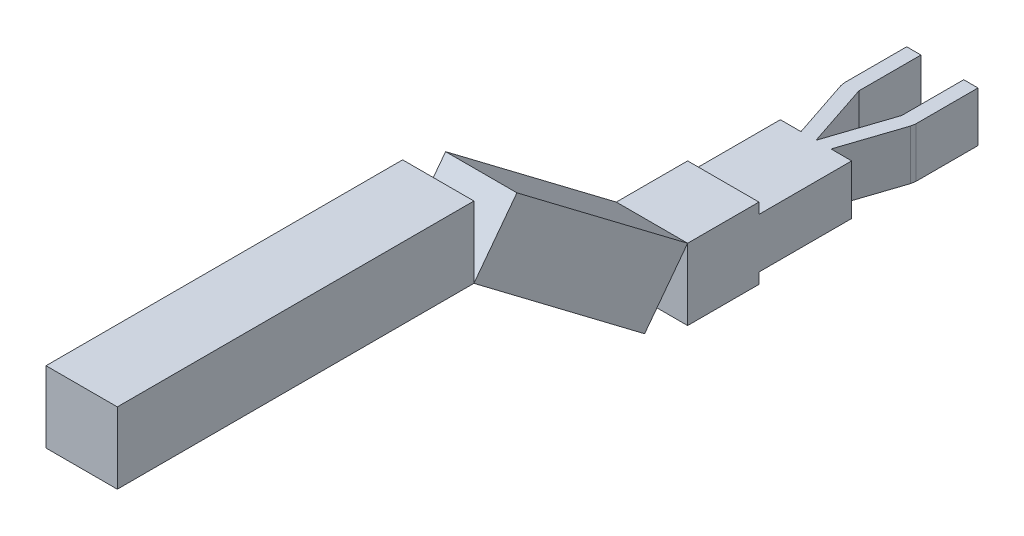
ISO-10303-21;
HEADER;
FILE_DESCRIPTION(('STEP AP214'),'2;1');
FILE_NAME('part.step','',(''),(''),'','','');
FILE_SCHEMA(('AUTOMOTIVE_DESIGN { 1 0 10303 214 1 1 1 1 }'));
ENDSEC;
DATA;
#1=APPLICATION_CONTEXT('core data for automotive mechanical design processes');
#2=APPLICATION_PROTOCOL_DEFINITION('international standard','automotive_design',2000,#1);
#3=PRODUCT_CONTEXT('',#1,'mechanical');
#4=PRODUCT('Part','Part','',(#3));
#5=PRODUCT_RELATED_PRODUCT_CATEGORY('part','',(#4));
#6=PRODUCT_DEFINITION_FORMATION('','',#4);
#7=PRODUCT_DEFINITION_CONTEXT('part definition',#1,'design');
#8=PRODUCT_DEFINITION('design','',#6,#7);
#9=PRODUCT_DEFINITION_SHAPE('','',#8);
#10=(LENGTH_UNIT() NAMED_UNIT(*) SI_UNIT(.MILLI.,.METRE.));
#11=(NAMED_UNIT(*) PLANE_ANGLE_UNIT() SI_UNIT($,.RADIAN.));
#12=(NAMED_UNIT(*) SI_UNIT($,.STERADIAN.) SOLID_ANGLE_UNIT());
#13=UNCERTAINTY_MEASURE_WITH_UNIT(LENGTH_MEASURE(1.E-05),#10,'distance_accuracy_value','');
#14=(GEOMETRIC_REPRESENTATION_CONTEXT(3) GLOBAL_UNCERTAINTY_ASSIGNED_CONTEXT((#13)) GLOBAL_UNIT_ASSIGNED_CONTEXT((#10,
#11,#12)) REPRESENTATION_CONTEXT('',''));
#15=CARTESIAN_POINT('',(0.,0.,0.));
#16=DIRECTION('',(0.,0.,1.));
#17=DIRECTION('',(1.,0.,0.));
#18=AXIS2_PLACEMENT_3D('',#15,#16,#17);
#19=CARTESIAN_POINT('',(50.0000000000001,186.100667301287,635.399647205051));
#20=DIRECTION('',(0.,0.,-1.));
#21=DIRECTION('',(-1.,0.,0.));
#22=AXIS2_PLACEMENT_3D('',#19,#20,#21);
#23=PLANE('',#22);
#24=DIRECTION('',(0.,-1.,0.));
#25=VECTOR('',#24,1.);
#26=CARTESIAN_POINT('',(-50.,186.100667301287,635.399647205051));
#27=LINE('',#26,#25);
#28=CARTESIAN_POINT('',(-50.,286.100667301287,635.399647205051));
#29=VERTEX_POINT('',#28);
#30=CARTESIAN_POINT('',(-50.,186.100667301287,635.399647205051));
#31=VERTEX_POINT('',#30);
#32=EDGE_CURVE('E108',#29,#31,#27,.T.);
#33=ORIENTED_EDGE('',*,*,#32,.F.);
#34=DIRECTION('',(-1.,0.,0.));
#35=VECTOR('',#34,1.);
#36=CARTESIAN_POINT('',(50.0000000000001,286.100667301287,635.399647205051));
#37=LINE('',#36,#35);
#38=CARTESIAN_POINT('',(50.0000000000001,286.100667301287,635.399647205051));
#39=VERTEX_POINT('',#38);
#40=EDGE_CURVE('E12',#39,#29,#37,.T.);
#41=ORIENTED_EDGE('',*,*,#40,.F.);
#42=DIRECTION('',(0.,-1.,0.));
#43=VECTOR('',#42,1.);
#44=CARTESIAN_POINT('',(50.0000000000001,186.100667301287,635.399647205051));
#45=LINE('',#44,#43);
#46=CARTESIAN_POINT('',(50.0000000000001,186.100667301287,635.399647205051));
#47=VERTEX_POINT('',#46);
#48=EDGE_CURVE('E102',#39,#47,#45,.T.);
#49=ORIENTED_EDGE('',*,*,#48,.T.);
#50=DIRECTION('',(-1.,0.,0.));
#51=VECTOR('',#50,1.);
#52=CARTESIAN_POINT('',(50.0000000000001,186.100667301287,635.399647205051));
#53=LINE('',#52,#51);
#54=EDGE_CURVE('E47',#47,#31,#53,.T.);
#55=ORIENTED_EDGE('',*,*,#54,.T.);
#56=EDGE_LOOP('',(#33,#41,#49,#55));
#57=FACE_BOUND('',#56,.T.);
#58=ADVANCED_FACE('F44',(#57),#23,.T.);
#59=CARTESIAN_POINT('',(50.0000000000001,286.100667301287,635.399647205051));
#60=DIRECTION('',(0.,1.,0.));
#61=DIRECTION('',(-1.,0.,0.));
#62=AXIS2_PLACEMENT_3D('',#59,#60,#61);
#63=PLANE('',#62);
#64=DIRECTION('',(0.,0.,-1.));
#65=VECTOR('',#64,1.);
#66=CARTESIAN_POINT('',(-50.,286.100667301287,635.399647205051));
#67=LINE('',#66,#65);
#68=CARTESIAN_POINT('',(-49.9999999999999,286.100667301287,1135.39964720505));
#69=VERTEX_POINT('',#68);
#70=EDGE_CURVE('E104',#69,#29,#67,.T.);
#71=ORIENTED_EDGE('',*,*,#70,.F.);
#72=DIRECTION('',(-1.,0.,0.));
#73=VECTOR('',#72,1.);
#74=CARTESIAN_POINT('',(50.0000000000001,286.100667301287,1135.39964720505));
#75=LINE('',#74,#73);
#76=CARTESIAN_POINT('',(50.0000000000001,286.100667301287,1135.39964720505));
#77=VERTEX_POINT('',#76);
#78=EDGE_CURVE('E53',#77,#69,#75,.T.);
#79=ORIENTED_EDGE('',*,*,#78,.F.);
#80=DIRECTION('',(0.,0.,-1.));
#81=VECTOR('',#80,1.);
#82=CARTESIAN_POINT('',(50.0000000000001,286.100667301287,635.399647205051));
#83=LINE('',#82,#81);
#84=EDGE_CURVE('E99',#77,#39,#83,.T.);
#85=ORIENTED_EDGE('',*,*,#84,.T.);
#86=ORIENTED_EDGE('',*,*,#40,.T.);
#87=EDGE_LOOP('',(#71,#79,#85,#86));
#88=FACE_BOUND('',#87,.T.);
#89=ADVANCED_FACE('F118',(#88),#63,.T.);
#90=CARTESIAN_POINT('',(50.0000000000001,186.100667301287,1135.39964720505));
#91=DIRECTION('',(0.,0.,1.));
#92=DIRECTION('',(1.,0.,0.));
#93=AXIS2_PLACEMENT_3D('',#90,#91,#92);
#94=PLANE('',#93);
#95=DIRECTION('',(0.,1.,0.));
#96=VECTOR('',#95,1.);
#97=CARTESIAN_POINT('',(-49.9999999999999,186.100667301287,1135.39964720505));
#98=LINE('',#97,#96);
#99=CARTESIAN_POINT('',(-49.9999999999999,186.100667301287,1135.39964720505));
#100=VERTEX_POINT('',#99);
#101=EDGE_CURVE('E94',#100,#69,#98,.T.);
#102=ORIENTED_EDGE('',*,*,#101,.F.);
#103=DIRECTION('',(-1.,0.,0.));
#104=VECTOR('',#103,1.);
#105=CARTESIAN_POINT('',(50.0000000000001,186.100667301287,1135.39964720505));
#106=LINE('',#105,#104);
#107=CARTESIAN_POINT('',(50.0000000000001,186.100667301287,1135.39964720505));
#108=VERTEX_POINT('',#107);
#109=EDGE_CURVE('E89',#108,#100,#106,.T.);
#110=ORIENTED_EDGE('',*,*,#109,.F.);
#111=DIRECTION('',(0.,1.,0.));
#112=VECTOR('',#111,1.);
#113=CARTESIAN_POINT('',(50.0000000000001,186.100667301287,1135.39964720505));
#114=LINE('',#113,#112);
#115=EDGE_CURVE('E92',#108,#77,#114,.T.);
#116=ORIENTED_EDGE('',*,*,#115,.T.);
#117=ORIENTED_EDGE('',*,*,#78,.T.);
#118=EDGE_LOOP('',(#102,#110,#116,#117));
#119=FACE_BOUND('',#118,.T.);
#120=ADVANCED_FACE('F91',(#119),#94,.T.);
#121=CARTESIAN_POINT('',(50.0000000000001,186.100667301287,635.399647205051));
#122=DIRECTION('',(0.,-1.,0.));
#123=DIRECTION('',(1.,0.,0.));
#124=AXIS2_PLACEMENT_3D('',#121,#122,#123);
#125=PLANE('',#124);
#126=DIRECTION('',(0.,0.,1.));
#127=VECTOR('',#126,1.);
#128=CARTESIAN_POINT('',(-50.,186.100667301287,635.399647205051));
#129=LINE('',#128,#127);
#130=EDGE_CURVE('E111',#31,#100,#129,.T.);
#131=ORIENTED_EDGE('',*,*,#130,.F.);
#132=ORIENTED_EDGE('',*,*,#54,.F.);
#133=DIRECTION('',(0.,0.,1.));
#134=VECTOR('',#133,1.);
#135=CARTESIAN_POINT('',(50.0000000000001,186.100667301287,635.399647205051));
#136=LINE('',#135,#134);
#137=EDGE_CURVE('E98',#47,#108,#136,.T.);
#138=ORIENTED_EDGE('',*,*,#137,.T.);
#139=ORIENTED_EDGE('',*,*,#109,.T.);
#140=EDGE_LOOP('',(#131,#132,#138,#139));
#141=FACE_BOUND('',#140,.T.);
#142=ADVANCED_FACE('F101',(#141),#125,.T.);
#143=CARTESIAN_POINT('',(50.,0.,0.));
#144=DIRECTION('',(1.,0.,0.));
#145=DIRECTION('',(0.,0.,-1.));
#146=AXIS2_PLACEMENT_3D('',#143,#144,#145);
#147=PLANE('',#146);
#148=ORIENTED_EDGE('',*,*,#48,.F.);
#149=ORIENTED_EDGE('',*,*,#84,.F.);
#150=ORIENTED_EDGE('',*,*,#115,.F.);
#151=ORIENTED_EDGE('',*,*,#137,.F.);
#152=EDGE_LOOP('',(#148,#149,#150,#151));
#153=FACE_BOUND('',#152,.T.);
#154=ADVANCED_FACE('F97',(#153),#147,.T.);
#155=CARTESIAN_POINT('',(-50.,0.,0.));
#156=DIRECTION('',(1.,0.,0.));
#157=DIRECTION('',(0.,0.,-1.));
#158=AXIS2_PLACEMENT_3D('',#155,#156,#157);
#159=PLANE('',#158);
#160=ORIENTED_EDGE('',*,*,#32,.T.);
#161=ORIENTED_EDGE('',*,*,#130,.T.);
#162=ORIENTED_EDGE('',*,*,#101,.T.);
#163=ORIENTED_EDGE('',*,*,#70,.T.);
#164=EDGE_LOOP('',(#160,#161,#162,#163));
#165=FACE_BOUND('',#164,.T.);
#166=ADVANCED_FACE('F117',(#165),#159,.F.);
#167=CLOSED_SHELL('',(#58,#89,#120,#142,#154,#166));
#168=MANIFOLD_SOLID_BREP('B2',#167);
#169=CARTESIAN_POINT('',(50.,85.,335.768782521129));
#170=DIRECTION('',(0.,0.797791926750478,-0.602932866587782));
#171=DIRECTION('',(0.,0.602932866587782,0.797791926750478));
#172=AXIS2_PLACEMENT_3D('',#169,#170,#171);
#173=PLANE('',#172);
#174=DIRECTION('',(0.,-0.602932866587782,-0.797791926750478));
#175=VECTOR('',#174,1.);
#176=CARTESIAN_POINT('',(-50.,85.,335.768782521129));
#177=LINE('',#176,#175);
#178=CARTESIAN_POINT('',(-50.,265.879859976335,575.106360546273));
#179=VERTEX_POINT('',#178);
#180=CARTESIAN_POINT('',(-50.,85.,335.768782521129));
#181=VERTEX_POINT('',#180);
#182=EDGE_CURVE('E241',#179,#181,#177,.T.);
#183=ORIENTED_EDGE('',*,*,#182,.F.);
#184=DIRECTION('',(-1.,0.,0.));
#185=VECTOR('',#184,1.);
#186=CARTESIAN_POINT('',(50.,265.879859976335,575.106360546273));
#187=LINE('',#186,#185);
#188=CARTESIAN_POINT('',(50.,265.879859976335,575.106360546273));
#189=VERTEX_POINT('',#188);
#190=EDGE_CURVE('E42',#189,#179,#187,.T.);
#191=ORIENTED_EDGE('',*,*,#190,.F.);
#192=DIRECTION('',(0.,-0.602932866587782,-0.797791926750478));
#193=VECTOR('',#192,1.);
#194=CARTESIAN_POINT('',(50.,85.,335.768782521129));
#195=LINE('',#194,#193);
#196=CARTESIAN_POINT('',(50.,85.,335.768782521129));
#197=VERTEX_POINT('',#196);
#198=EDGE_CURVE('E235',#189,#197,#195,.T.);
#199=ORIENTED_EDGE('',*,*,#198,.T.);
#200=DIRECTION('',(-1.,0.,0.));
#201=VECTOR('',#200,1.);
#202=CARTESIAN_POINT('',(50.,85.,335.768782521129));
#203=LINE('',#202,#201);
#204=EDGE_CURVE('E180',#197,#181,#203,.T.);
#205=ORIENTED_EDGE('',*,*,#204,.T.);
#206=EDGE_LOOP('',(#183,#191,#199,#205));
#207=FACE_BOUND('',#206,.T.);
#208=ADVANCED_FACE('F177',(#207),#173,.T.);
#209=CARTESIAN_POINT('',(50.,265.879859976335,575.106360546273));
#210=DIRECTION('',(0.,0.602932866587782,0.797791926750478));
#211=DIRECTION('',(0.,-0.797791926750478,0.602932866587782));
#212=AXIS2_PLACEMENT_3D('',#209,#210,#211);
#213=PLANE('',#212);
#214=DIRECTION('',(0.,0.797791926750478,-0.602932866587782));
#215=VECTOR('',#214,1.);
#216=CARTESIAN_POINT('',(-50.,265.879859976335,575.106360546273));
#217=LINE('',#216,#215);
#218=CARTESIAN_POINT('',(-50.,186.100667301287,635.399647205051));
#219=VERTEX_POINT('',#218);
#220=EDGE_CURVE('E237',#219,#179,#217,.T.);
#221=ORIENTED_EDGE('',*,*,#220,.F.);
#222=DIRECTION('',(-1.,0.,0.));
#223=VECTOR('',#222,1.);
#224=CARTESIAN_POINT('',(50.0000000000001,186.100667301287,635.399647205051));
#225=LINE('',#224,#223);
#226=CARTESIAN_POINT('',(50.0000000000001,186.100667301287,635.399647205051));
#227=VERTEX_POINT('',#226);
#228=EDGE_CURVE('E186',#227,#219,#225,.T.);
#229=ORIENTED_EDGE('',*,*,#228,.F.);
#230=DIRECTION('',(0.,0.797791926750478,-0.602932866587782));
#231=VECTOR('',#230,1.);
#232=CARTESIAN_POINT('',(50.,265.879859976335,575.106360546273));
#233=LINE('',#232,#231);
#234=EDGE_CURVE('E232',#227,#189,#233,.T.);
#235=ORIENTED_EDGE('',*,*,#234,.T.);
#236=ORIENTED_EDGE('',*,*,#190,.T.);
#237=EDGE_LOOP('',(#221,#229,#235,#236));
#238=FACE_BOUND('',#237,.T.);
#239=ADVANCED_FACE('F251',(#238),#213,.T.);
#240=CARTESIAN_POINT('',(50.,5.22080732495214,396.062069179907));
#241=DIRECTION('',(0.,-0.797791926750478,0.602932866587782));
#242=DIRECTION('',(0.,-0.602932866587782,-0.797791926750478));
#243=AXIS2_PLACEMENT_3D('',#240,#241,#242);
#244=PLANE('',#243);
#245=DIRECTION('',(0.,0.602932866587782,0.797791926750478));
#246=VECTOR('',#245,1.);
#247=CARTESIAN_POINT('',(-50.,5.22080732495214,396.062069179907));
#248=LINE('',#247,#246);
#249=CARTESIAN_POINT('',(-50.,5.22080732495214,396.062069179907));
#250=VERTEX_POINT('',#249);
#251=EDGE_CURVE('E227',#250,#219,#248,.T.);
#252=ORIENTED_EDGE('',*,*,#251,.F.);
#253=DIRECTION('',(-1.,0.,0.));
#254=VECTOR('',#253,1.);
#255=CARTESIAN_POINT('',(50.,5.22080732495214,396.062069179907));
#256=LINE('',#255,#254);
#257=CARTESIAN_POINT('',(50.,5.22080732495214,396.062069179907));
#258=VERTEX_POINT('',#257);
#259=EDGE_CURVE('E222',#258,#250,#256,.T.);
#260=ORIENTED_EDGE('',*,*,#259,.F.);
#261=DIRECTION('',(0.,0.602932866587782,0.797791926750478));
#262=VECTOR('',#261,1.);
#263=CARTESIAN_POINT('',(50.,5.22080732495214,396.062069179907));
#264=LINE('',#263,#262);
#265=EDGE_CURVE('E225',#258,#227,#264,.T.);
#266=ORIENTED_EDGE('',*,*,#265,.T.);
#267=ORIENTED_EDGE('',*,*,#228,.T.);
#268=EDGE_LOOP('',(#252,#260,#266,#267));
#269=FACE_BOUND('',#268,.T.);
#270=ADVANCED_FACE('F224',(#269),#244,.T.);
#271=CARTESIAN_POINT('',(50.,85.,335.768782521129));
#272=DIRECTION('',(0.,-0.602932866587781,-0.797791926750478));
#273=DIRECTION('',(0.,0.797791926750478,-0.602932866587781));
#274=AXIS2_PLACEMENT_3D('',#271,#272,#273);
#275=PLANE('',#274);
#276=DIRECTION('',(0.,-0.797791926750478,0.602932866587781));
#277=VECTOR('',#276,1.);
#278=CARTESIAN_POINT('',(-50.,85.,335.768782521129));
#279=LINE('',#278,#277);
#280=EDGE_CURVE('E244',#181,#250,#279,.T.);
#281=ORIENTED_EDGE('',*,*,#280,.F.);
#282=ORIENTED_EDGE('',*,*,#204,.F.);
#283=DIRECTION('',(0.,-0.797791926750478,0.602932866587781));
#284=VECTOR('',#283,1.);
#285=CARTESIAN_POINT('',(50.,85.,335.768782521129));
#286=LINE('',#285,#284);
#287=EDGE_CURVE('E231',#197,#258,#286,.T.);
#288=ORIENTED_EDGE('',*,*,#287,.T.);
#289=ORIENTED_EDGE('',*,*,#259,.T.);
#290=EDGE_LOOP('',(#281,#282,#288,#289));
#291=FACE_BOUND('',#290,.T.);
#292=ADVANCED_FACE('F234',(#291),#275,.T.);
#293=CARTESIAN_POINT('',(50.,0.,0.));
#294=DIRECTION('',(1.,0.,0.));
#295=DIRECTION('',(0.,0.,-1.));
#296=AXIS2_PLACEMENT_3D('',#293,#294,#295);
#297=PLANE('',#296);
#298=ORIENTED_EDGE('',*,*,#198,.F.);
#299=ORIENTED_EDGE('',*,*,#234,.F.);
#300=ORIENTED_EDGE('',*,*,#265,.F.);
#301=ORIENTED_EDGE('',*,*,#287,.F.);
#302=EDGE_LOOP('',(#298,#299,#300,#301));
#303=FACE_BOUND('',#302,.T.);
#304=ADVANCED_FACE('F230',(#303),#297,.T.);
#305=CARTESIAN_POINT('',(-50.,0.,0.));
#306=DIRECTION('',(1.,0.,0.));
#307=DIRECTION('',(0.,0.,-1.));
#308=AXIS2_PLACEMENT_3D('',#305,#306,#307);
#309=PLANE('',#308);
#310=ORIENTED_EDGE('',*,*,#182,.T.);
#311=ORIENTED_EDGE('',*,*,#280,.T.);
#312=ORIENTED_EDGE('',*,*,#251,.T.);
#313=ORIENTED_EDGE('',*,*,#220,.T.);
#314=EDGE_LOOP('',(#310,#311,#312,#313));
#315=FACE_BOUND('',#314,.T.);
#316=ADVANCED_FACE('F250',(#315),#309,.F.);
#317=CLOSED_SHELL('',(#208,#239,#270,#292,#304,#316));
#318=MANIFOLD_SOLID_BREP('B6',#317);
#319=CARTESIAN_POINT('',(-50.,70.,-71.3699993654707));
#320=DIRECTION('',(1.,0.,0.));
#321=DIRECTION('',(0.,0.,-1.));
#322=AXIS2_PLACEMENT_3D('',#319,#320,#321);
#323=PLANE('',#322);
#324=DIRECTION('',(0.,0.,1.));
#325=VECTOR('',#324,1.);
#326=CARTESIAN_POINT('',(-50.,0.,-71.3699993654707));
#327=LINE('',#326,#325);
#328=CARTESIAN_POINT('',(-50.,0.,-71.3699993654707));
#329=VERTEX_POINT('',#328);
#330=CARTESIAN_POINT('',(-50.,0.,15.6300006345293));
#331=VERTEX_POINT('',#330);
#332=EDGE_CURVE('E447',#329,#331,#327,.T.);
#333=ORIENTED_EDGE('',*,*,#332,.T.);
#334=DIRECTION('',(0.,-1.,0.));
#335=VECTOR('',#334,1.);
#336=CARTESIAN_POINT('',(-50.,70.,15.6300006345293));
#337=LINE('',#336,#335);
#338=CARTESIAN_POINT('',(-50.,70.,15.6300006345293));
#339=VERTEX_POINT('',#338);
#340=EDGE_CURVE('E175',#339,#331,#337,.T.);
#341=ORIENTED_EDGE('',*,*,#340,.F.);
#342=DIRECTION('',(0.,0.,1.));
#343=VECTOR('',#342,1.);
#344=CARTESIAN_POINT('',(-50.,70.,-71.3699993654707));
#345=LINE('',#344,#343);
#346=CARTESIAN_POINT('',(-50.,70.,-71.3699993654707));
#347=VERTEX_POINT('',#346);
#348=EDGE_CURVE('E497',#347,#339,#345,.T.);
#349=ORIENTED_EDGE('',*,*,#348,.F.);
#350=DIRECTION('',(0.,-1.,0.));
#351=VECTOR('',#350,1.);
#352=CARTESIAN_POINT('',(-50.,70.,-71.3699993654707));
#353=LINE('',#352,#351);
#354=EDGE_CURVE('E443',#347,#329,#353,.T.);
#355=ORIENTED_EDGE('',*,*,#354,.T.);
#356=EDGE_LOOP('',(#333,#341,#349,#355));
#357=FACE_BOUND('',#356,.T.);
#358=ADVANCED_FACE('F301',(#357),#323,.F.);
#359=CARTESIAN_POINT('',(-48.9765856603368,70.,21.9457901082135));
#360=DIRECTION('',(0.98712443061066,0.,-0.159954238742149));
#361=DIRECTION('',(-0.159954238742149,0.,-0.98712443061066));
#362=AXIS2_PLACEMENT_3D('',#359,#360,#361);
#363=PLANE('',#362);
#364=DIRECTION('',(0.159954238742149,0.,0.98712443061066));
#365=VECTOR('',#364,1.);
#366=CARTESIAN_POINT('',(-48.9765856603368,0.,21.9457901082135));
#367=LINE('',#366,#365);
#368=CARTESIAN_POINT('',(-48.9765856603368,0.,21.9457901082135));
#369=VERTEX_POINT('',#368);
#370=EDGE_CURVE('E450',#331,#369,#367,.T.);
#371=ORIENTED_EDGE('',*,*,#370,.T.);
#372=DIRECTION('',(0.,-1.,0.));
#373=VECTOR('',#372,1.);
#374=CARTESIAN_POINT('',(-48.9765856603368,70.,21.9457901082135));
#375=LINE('',#374,#373);
#376=CARTESIAN_POINT('',(-48.9765856603368,70.,21.9457901082135));
#377=VERTEX_POINT('',#376);
#378=EDGE_CURVE('E310',#377,#369,#375,.T.);
#379=ORIENTED_EDGE('',*,*,#378,.F.);
#380=DIRECTION('',(0.159954238742149,0.,0.98712443061066));
#381=VECTOR('',#380,1.);
#382=CARTESIAN_POINT('',(-48.9765856603368,70.,21.9457901082135));
#383=LINE('',#382,#381);
#384=EDGE_CURVE('E384',#339,#377,#383,.T.);
#385=ORIENTED_EDGE('',*,*,#384,.F.);
#386=ORIENTED_EDGE('',*,*,#340,.T.);
#387=EDGE_LOOP('',(#371,#379,#385,#386));
#388=FACE_BOUND('',#387,.T.);
#389=ADVANCED_FACE('F578',(#388),#363,.F.);
#390=CARTESIAN_POINT('',(-21.0786074565587,70.,105.768782521129));
#391=DIRECTION('',(0.948829283016839,0.,-0.315789473684211));
#392=DIRECTION('',(-0.315789473684211,0.,-0.948829283016839));
#393=AXIS2_PLACEMENT_3D('',#390,#391,#392);
#394=PLANE('',#393);
#395=DIRECTION('',(0.31578947368421,0.,0.948829283016839));
#396=VECTOR('',#395,1.);
#397=CARTESIAN_POINT('',(-21.0786074565587,0.,105.768782521129));
#398=LINE('',#397,#396);
#399=CARTESIAN_POINT('',(-21.0786074565587,0.,105.768782521129));
#400=VERTEX_POINT('',#399);
#401=EDGE_CURVE('E453',#369,#400,#398,.T.);
#402=ORIENTED_EDGE('',*,*,#401,.T.);
#403=DIRECTION('',(0.,-1.,0.));
#404=VECTOR('',#403,1.);
#405=CARTESIAN_POINT('',(-21.0786074565587,70.,105.768782521129));
#406=LINE('',#405,#404);
#407=CARTESIAN_POINT('',(-21.0786074565587,70.,105.768782521129));
#408=VERTEX_POINT('',#407);
#409=EDGE_CURVE('E522',#408,#400,#406,.T.);
#410=ORIENTED_EDGE('',*,*,#409,.F.);
#411=DIRECTION('',(0.31578947368421,0.,0.948829283016839));
#412=VECTOR('',#411,1.);
#413=CARTESIAN_POINT('',(-21.0786074565587,70.,105.768782521129));
#414=LINE('',#413,#412);
#415=EDGE_CURVE('E814',#377,#408,#414,.T.);
#416=ORIENTED_EDGE('',*,*,#415,.F.);
#417=ORIENTED_EDGE('',*,*,#378,.T.);
#418=EDGE_LOOP('',(#402,#410,#416,#417));
#419=FACE_BOUND('',#418,.T.);
#420=ADVANCED_FACE('F582',(#419),#394,.F.);
#421=CARTESIAN_POINT('',(-50.,70.,105.768782521129));
#422=DIRECTION('',(0.,0.,1.));
#423=DIRECTION('',(1.,0.,0.));
#424=AXIS2_PLACEMENT_3D('',#421,#422,#423);
#425=PLANE('',#424);
#426=DIRECTION('',(-1.,0.,0.));
#427=VECTOR('',#426,1.);
#428=CARTESIAN_POINT('',(-50.,0.,105.768782521129));
#429=LINE('',#428,#427);
#430=CARTESIAN_POINT('',(-50.,0.,105.768782521129));
#431=VERTEX_POINT('',#430);
#432=EDGE_CURVE('E455',#400,#431,#429,.T.);
#433=ORIENTED_EDGE('',*,*,#432,.T.);
#434=DIRECTION('',(0.,-1.,0.));
#435=VECTOR('',#434,1.);
#436=CARTESIAN_POINT('',(-50.,70.,105.768782521129));
#437=LINE('',#436,#435);
#438=CARTESIAN_POINT('',(-50.,70.,105.768782521129));
#439=VERTEX_POINT('',#438);
#440=EDGE_CURVE('E519',#439,#431,#437,.T.);
#441=ORIENTED_EDGE('',*,*,#440,.F.);
#442=DIRECTION('',(-1.,0.,0.));
#443=VECTOR('',#442,1.);
#444=CARTESIAN_POINT('',(-50.,70.,105.768782521129));
#445=LINE('',#444,#443);
#446=EDGE_CURVE('E537',#408,#439,#445,.T.);
#447=ORIENTED_EDGE('',*,*,#446,.F.);
#448=ORIENTED_EDGE('',*,*,#409,.T.);
#449=EDGE_LOOP('',(#433,#441,#447,#448));
#450=FACE_BOUND('',#449,.T.);
#451=ADVANCED_FACE('F586',(#450),#425,.F.);
#452=CARTESIAN_POINT('',(-50.,70.,105.768782521129));
#453=DIRECTION('',(1.,0.,0.));
#454=DIRECTION('',(0.,0.,-1.));
#455=AXIS2_PLACEMENT_3D('',#452,#453,#454);
#456=PLANE('',#455);
#457=DIRECTION('',(0.,0.,1.));
#458=VECTOR('',#457,1.);
#459=CARTESIAN_POINT('',(-50.,0.,105.768782521129));
#460=LINE('',#459,#458);
#461=CARTESIAN_POINT('',(-50.,0.,235.768782521129));
#462=VERTEX_POINT('',#461);
#463=EDGE_CURVE('E457',#431,#462,#460,.T.);
#464=ORIENTED_EDGE('',*,*,#463,.T.);
#465=DIRECTION('',(0.,-1.,0.));
#466=VECTOR('',#465,1.);
#467=CARTESIAN_POINT('',(-50.,85.,235.768782521129));
#468=LINE('',#467,#466);
#469=CARTESIAN_POINT('',(-50.,-15.,235.768782521129));
#470=VERTEX_POINT('',#469);
#471=EDGE_CURVE('E718',#462,#470,#468,.T.);
#472=ORIENTED_EDGE('',*,*,#471,.T.);
#473=DIRECTION('',(0.,0.,-1.));
#474=VECTOR('',#473,1.);
#475=CARTESIAN_POINT('',(-50.,-15.,335.768782521129));
#476=LINE('',#475,#474);
#477=CARTESIAN_POINT('',(-50.,-15.,335.768782521129));
#478=VERTEX_POINT('',#477);
#479=EDGE_CURVE('E780',#478,#470,#476,.T.);
#480=ORIENTED_EDGE('',*,*,#479,.F.);
#481=DIRECTION('',(0.,-1.,0.));
#482=VECTOR('',#481,1.);
#483=CARTESIAN_POINT('',(-50.,85.,335.768782521129));
#484=LINE('',#483,#482);
#485=CARTESIAN_POINT('',(-50.,85.,335.768782521129));
#486=VERTEX_POINT('',#485);
#487=EDGE_CURVE('E767',#486,#478,#484,.T.);
#488=ORIENTED_EDGE('',*,*,#487,.F.);
#489=DIRECTION('',(0.,0.,-1.));
#490=VECTOR('',#489,1.);
#491=CARTESIAN_POINT('',(-50.,85.,335.768782521129));
#492=LINE('',#491,#490);
#493=CARTESIAN_POINT('',(-50.,85.,235.768782521129));
#494=VERTEX_POINT('',#493);
#495=EDGE_CURVE('E765',#486,#494,#492,.T.);
#496=ORIENTED_EDGE('',*,*,#495,.T.);
#497=CARTESIAN_POINT('',(-50.,70.,235.768782521129));
#498=VERTEX_POINT('',#497);
#499=EDGE_CURVE('E729',#494,#498,#468,.T.);
#500=ORIENTED_EDGE('',*,*,#499,.T.);
#501=DIRECTION('',(0.,0.,1.));
#502=VECTOR('',#501,1.);
#503=CARTESIAN_POINT('',(-50.,70.,105.768782521129));
#504=LINE('',#503,#502);
#505=EDGE_CURVE('E532',#439,#498,#504,.T.);
#506=ORIENTED_EDGE('',*,*,#505,.F.);
#507=ORIENTED_EDGE('',*,*,#440,.T.);
#508=EDGE_LOOP('',(#464,#472,#480,#488,#496,#500,#506,#507));
#509=FACE_BOUND('',#508,.T.);
#510=ADVANCED_FACE('F592',(#509),#456,.F.);
#511=CARTESIAN_POINT('',(50.,70.,105.768782521129));
#512=DIRECTION('',(-1.,0.,0.));
#513=DIRECTION('',(0.,0.,1.));
#514=AXIS2_PLACEMENT_3D('',#511,#512,#513);
#515=PLANE('',#514);
#516=DIRECTION('',(0.,0.,-1.));
#517=VECTOR('',#516,1.);
#518=CARTESIAN_POINT('',(50.,0.,105.768782521129));
#519=LINE('',#518,#517);
#520=CARTESIAN_POINT('',(50.,0.,235.768782521129));
#521=VERTEX_POINT('',#520);
#522=CARTESIAN_POINT('',(50.,0.,105.768782521129));
#523=VERTEX_POINT('',#522);
#524=EDGE_CURVE('E466',#521,#523,#519,.T.);
#525=ORIENTED_EDGE('',*,*,#524,.T.);
#526=DIRECTION('',(0.,-1.,0.));
#527=VECTOR('',#526,1.);
#528=CARTESIAN_POINT('',(50.,70.,105.768782521129));
#529=LINE('',#528,#527);
#530=CARTESIAN_POINT('',(50.,70.,105.768782521129));
#531=VERTEX_POINT('',#530);
#532=EDGE_CURVE('E517',#531,#523,#529,.T.);
#533=ORIENTED_EDGE('',*,*,#532,.F.);
#534=DIRECTION('',(0.,0.,-1.));
#535=VECTOR('',#534,1.);
#536=CARTESIAN_POINT('',(50.,70.,105.768782521129));
#537=LINE('',#536,#535);
#538=CARTESIAN_POINT('',(50.,70.,235.768782521129));
#539=VERTEX_POINT('',#538);
#540=EDGE_CURVE('E531',#539,#531,#537,.T.);
#541=ORIENTED_EDGE('',*,*,#540,.F.);
#542=DIRECTION('',(0.,1.,0.));
#543=VECTOR('',#542,1.);
#544=CARTESIAN_POINT('',(50.,85.,235.768782521129));
#545=LINE('',#544,#543);
#546=CARTESIAN_POINT('',(50.,85.,235.768782521129));
#547=VERTEX_POINT('',#546);
#548=EDGE_CURVE('E777',#539,#547,#545,.T.);
#549=ORIENTED_EDGE('',*,*,#548,.T.);
#550=DIRECTION('',(0.,0.,-1.));
#551=VECTOR('',#550,1.);
#552=CARTESIAN_POINT('',(50.,85.,335.768782521129));
#553=LINE('',#552,#551);
#554=CARTESIAN_POINT('',(50.,85.,335.768782521129));
#555=VERTEX_POINT('',#554);
#556=EDGE_CURVE('E451',#555,#547,#553,.T.);
#557=ORIENTED_EDGE('',*,*,#556,.F.);
#558=DIRECTION('',(0.,1.,0.));
#559=VECTOR('',#558,1.);
#560=CARTESIAN_POINT('',(50.,85.,335.768782521129));
#561=LINE('',#560,#559);
#562=CARTESIAN_POINT('',(50.,-15.,335.768782521129));
#563=VERTEX_POINT('',#562);
#564=EDGE_CURVE('E768',#563,#555,#561,.T.);
#565=ORIENTED_EDGE('',*,*,#564,.F.);
#566=DIRECTION('',(0.,0.,-1.));
#567=VECTOR('',#566,1.);
#568=CARTESIAN_POINT('',(50.,-15.,335.768782521129));
#569=LINE('',#568,#567);
#570=CARTESIAN_POINT('',(50.,-15.,235.768782521129));
#571=VERTEX_POINT('',#570);
#572=EDGE_CURVE('E802',#563,#571,#569,.T.);
#573=ORIENTED_EDGE('',*,*,#572,.T.);
#574=EDGE_CURVE('E784',#571,#521,#545,.T.);
#575=ORIENTED_EDGE('',*,*,#574,.T.);
#576=EDGE_LOOP('',(#525,#533,#541,#549,#557,#565,#573,#575));
#577=FACE_BOUND('',#576,.T.);
#578=ADVANCED_FACE('F596',(#577),#515,.F.);
#579=CARTESIAN_POINT('',(21.0786074565587,70.,105.768782521129));
#580=DIRECTION('',(0.,0.,1.));
#581=DIRECTION('',(1.,0.,0.));
#582=AXIS2_PLACEMENT_3D('',#579,#580,#581);
#583=PLANE('',#582);
#584=DIRECTION('',(-1.,0.,0.));
#585=VECTOR('',#584,1.);
#586=CARTESIAN_POINT('',(21.0786074565587,0.,105.768782521129));
#587=LINE('',#586,#585);
#588=CARTESIAN_POINT('',(21.0786074565587,0.,105.768782521129));
#589=VERTEX_POINT('',#588);
#590=EDGE_CURVE('E460',#523,#589,#587,.T.);
#591=ORIENTED_EDGE('',*,*,#590,.T.);
#592=DIRECTION('',(0.,-1.,0.));
#593=VECTOR('',#592,1.);
#594=CARTESIAN_POINT('',(21.0786074565587,70.,105.768782521129));
#595=LINE('',#594,#593);
#596=CARTESIAN_POINT('',(21.0786074565587,70.,105.768782521129));
#597=VERTEX_POINT('',#596);
#598=EDGE_CURVE('E515',#597,#589,#595,.T.);
#599=ORIENTED_EDGE('',*,*,#598,.F.);
#600=DIRECTION('',(-1.,0.,0.));
#601=VECTOR('',#600,1.);
#602=CARTESIAN_POINT('',(21.0786074565587,70.,105.768782521129));
#603=LINE('',#602,#601);
#604=EDGE_CURVE('E539',#531,#597,#603,.T.);
#605=ORIENTED_EDGE('',*,*,#604,.F.);
#606=ORIENTED_EDGE('',*,*,#532,.T.);
#607=EDGE_LOOP('',(#591,#599,#605,#606));
#608=FACE_BOUND('',#607,.T.);
#609=ADVANCED_FACE('F600',(#608),#583,.F.);
#610=CARTESIAN_POINT('',(21.0786074565587,70.,105.768782521129));
#611=DIRECTION('',(-0.948829283016839,0.,-0.31578947368421));
#612=DIRECTION('',(-0.31578947368421,0.,0.948829283016839));
#613=AXIS2_PLACEMENT_3D('',#610,#611,#612);
#614=PLANE('',#613);
#615=DIRECTION('',(0.31578947368421,0.,-0.948829283016839));
#616=VECTOR('',#615,1.);
#617=CARTESIAN_POINT('',(21.0786074565587,0.,105.768782521129));
#618=LINE('',#617,#616);
#619=CARTESIAN_POINT('',(48.9765856603368,0.,21.9457901082136));
#620=VERTEX_POINT('',#619);
#621=EDGE_CURVE('E474',#589,#620,#618,.T.);
#622=ORIENTED_EDGE('',*,*,#621,.T.);
#623=DIRECTION('',(0.,-1.,0.));
#624=VECTOR('',#623,1.);
#625=CARTESIAN_POINT('',(48.9765856603368,70.,21.9457901082136));
#626=LINE('',#625,#624);
#627=CARTESIAN_POINT('',(48.9765856603368,70.,21.9457901082136));
#628=VERTEX_POINT('',#627);
#629=EDGE_CURVE('E513',#628,#620,#626,.T.);
#630=ORIENTED_EDGE('',*,*,#629,.F.);
#631=DIRECTION('',(0.31578947368421,0.,-0.948829283016839));
#632=VECTOR('',#631,1.);
#633=CARTESIAN_POINT('',(21.0786074565587,70.,105.768782521129));
#634=LINE('',#633,#632);
#635=EDGE_CURVE('E541',#597,#628,#634,.T.);
#636=ORIENTED_EDGE('',*,*,#635,.F.);
#637=ORIENTED_EDGE('',*,*,#598,.T.);
#638=EDGE_LOOP('',(#622,#630,#636,#637));
#639=FACE_BOUND('',#638,.T.);
#640=ADVANCED_FACE('F603',(#639),#614,.F.);
#641=CARTESIAN_POINT('',(50.,70.,15.6300006345293));
#642=DIRECTION('',(-0.98712443061066,0.,-0.159954238742149));
#643=DIRECTION('',(-0.159954238742149,0.,0.98712443061066));
#644=AXIS2_PLACEMENT_3D('',#641,#642,#643);
#645=PLANE('',#644);
#646=DIRECTION('',(0.159954238742149,0.,-0.98712443061066));
#647=VECTOR('',#646,1.);
#648=CARTESIAN_POINT('',(50.,0.,15.6300006345293));
#649=LINE('',#648,#647);
#650=CARTESIAN_POINT('',(50.,0.,15.6300006345293));
#651=VERTEX_POINT('',#650);
#652=EDGE_CURVE('E479',#620,#651,#649,.T.);
#653=ORIENTED_EDGE('',*,*,#652,.T.);
#654=DIRECTION('',(0.,-1.,0.));
#655=VECTOR('',#654,1.);
#656=CARTESIAN_POINT('',(50.,70.,15.6300006345293));
#657=LINE('',#656,#655);
#658=CARTESIAN_POINT('',(50.,70.,15.6300006345293));
#659=VERTEX_POINT('',#658);
#660=EDGE_CURVE('E510',#659,#651,#657,.T.);
#661=ORIENTED_EDGE('',*,*,#660,.F.);
#662=DIRECTION('',(0.159954238742149,0.,-0.98712443061066));
#663=VECTOR('',#662,1.);
#664=CARTESIAN_POINT('',(50.,70.,15.6300006345293));
#665=LINE('',#664,#663);
#666=EDGE_CURVE('E543',#628,#659,#665,.T.);
#667=ORIENTED_EDGE('',*,*,#666,.F.);
#668=ORIENTED_EDGE('',*,*,#629,.T.);
#669=EDGE_LOOP('',(#653,#661,#667,#668));
#670=FACE_BOUND('',#669,.T.);
#671=ADVANCED_FACE('F606',(#670),#645,.F.);
#672=CARTESIAN_POINT('',(50.,70.,-71.3699993654707));
#673=DIRECTION('',(-1.,0.,0.));
#674=DIRECTION('',(0.,0.,1.));
#675=AXIS2_PLACEMENT_3D('',#672,#673,#674);
#676=PLANE('',#675);
#677=DIRECTION('',(0.,0.,-1.));
#678=VECTOR('',#677,1.);
#679=CARTESIAN_POINT('',(50.,0.,-71.3699993654707));
#680=LINE('',#679,#678);
#681=CARTESIAN_POINT('',(50.,0.,-71.3699993654707));
#682=VERTEX_POINT('',#681);
#683=EDGE_CURVE('E484',#651,#682,#680,.T.);
#684=ORIENTED_EDGE('',*,*,#683,.T.);
#685=DIRECTION('',(0.,-1.,0.));
#686=VECTOR('',#685,1.);
#687=CARTESIAN_POINT('',(50.,70.,-71.3699993654707));
#688=LINE('',#687,#686);
#689=CARTESIAN_POINT('',(50.,70.,-71.3699993654707));
#690=VERTEX_POINT('',#689);
#691=EDGE_CURVE('E507',#690,#682,#688,.T.);
#692=ORIENTED_EDGE('',*,*,#691,.F.);
#693=DIRECTION('',(0.,0.,-1.));
#694=VECTOR('',#693,1.);
#695=CARTESIAN_POINT('',(50.,70.,-71.3699993654707));
#696=LINE('',#695,#694);
#697=EDGE_CURVE('E545',#659,#690,#696,.T.);
#698=ORIENTED_EDGE('',*,*,#697,.F.);
#699=ORIENTED_EDGE('',*,*,#660,.T.);
#700=EDGE_LOOP('',(#684,#692,#698,#699));
#701=FACE_BOUND('',#700,.T.);
#702=ADVANCED_FACE('F609',(#701),#676,.F.);
#703=CARTESIAN_POINT('',(30.,70.,-71.3699993654707));
#704=DIRECTION('',(0.,0.,1.));
#705=DIRECTION('',(1.,0.,0.));
#706=AXIS2_PLACEMENT_3D('',#703,#704,#705);
#707=PLANE('',#706);
#708=DIRECTION('',(-1.,0.,0.));
#709=VECTOR('',#708,1.);
#710=CARTESIAN_POINT('',(30.,0.,-71.3699993654707));
#711=LINE('',#710,#709);
#712=CARTESIAN_POINT('',(30.,0.,-71.3699993654707));
#713=VERTEX_POINT('',#712);
#714=EDGE_CURVE('E488',#682,#713,#711,.T.);
#715=ORIENTED_EDGE('',*,*,#714,.T.);
#716=DIRECTION('',(0.,-1.,0.));
#717=VECTOR('',#716,1.);
#718=CARTESIAN_POINT('',(30.,70.,-71.3699993654707));
#719=LINE('',#718,#717);
#720=CARTESIAN_POINT('',(30.,70.,-71.3699993654707));
#721=VERTEX_POINT('',#720);
#722=EDGE_CURVE('E504',#721,#713,#719,.T.);
#723=ORIENTED_EDGE('',*,*,#722,.F.);
#724=DIRECTION('',(-1.,0.,0.));
#725=VECTOR('',#724,1.);
#726=CARTESIAN_POINT('',(30.,70.,-71.3699993654707));
#727=LINE('',#726,#725);
#728=EDGE_CURVE('E547',#690,#721,#727,.T.);
#729=ORIENTED_EDGE('',*,*,#728,.F.);
#730=ORIENTED_EDGE('',*,*,#691,.T.);
#731=EDGE_LOOP('',(#715,#723,#729,#730));
#732=FACE_BOUND('',#731,.T.);
#733=ADVANCED_FACE('F613',(#732),#707,.F.);
#734=CARTESIAN_POINT('',(30.,70.,-71.3699993654707));
#735=DIRECTION('',(1.,0.,0.));
#736=DIRECTION('',(0.,0.,-1.));
#737=AXIS2_PLACEMENT_3D('',#734,#735,#736);
#738=PLANE('',#737);
#739=DIRECTION('',(0.,0.,1.));
#740=VECTOR('',#739,1.);
#741=CARTESIAN_POINT('',(30.,0.,-71.3699993654707));
#742=LINE('',#741,#740);
#743=CARTESIAN_POINT('',(30.,0.,15.6300006345293));
#744=VERTEX_POINT('',#743);
#745=EDGE_CURVE('E490',#713,#744,#742,.T.);
#746=ORIENTED_EDGE('',*,*,#745,.T.);
#747=DIRECTION('',(0.,-1.,0.));
#748=VECTOR('',#747,1.);
#749=CARTESIAN_POINT('',(30.,70.,15.6300006345293));
#750=LINE('',#749,#748);
#751=CARTESIAN_POINT('',(30.,70.,15.6300006345293));
#752=VERTEX_POINT('',#751);
#753=EDGE_CURVE('E501',#752,#744,#750,.T.);
#754=ORIENTED_EDGE('',*,*,#753,.F.);
#755=DIRECTION('',(0.,0.,1.));
#756=VECTOR('',#755,1.);
#757=CARTESIAN_POINT('',(30.,70.,-71.3699993654707));
#758=LINE('',#757,#756);
#759=EDGE_CURVE('E549',#721,#752,#758,.T.);
#760=ORIENTED_EDGE('',*,*,#759,.F.);
#761=ORIENTED_EDGE('',*,*,#722,.T.);
#762=EDGE_LOOP('',(#746,#754,#760,#761));
#763=FACE_BOUND('',#762,.T.);
#764=ADVANCED_FACE('F555',(#763),#738,.F.);
#765=CARTESIAN_POINT('',(0.,70.,105.768782521129));
#766=DIRECTION('',(0.948829283016839,0.,0.31578947368421));
#767=DIRECTION('',(0.315789473684211,0.,-0.948829283016839));
#768=AXIS2_PLACEMENT_3D('',#765,#766,#767);
#769=PLANE('',#768);
#770=DIRECTION('',(-0.315789473684211,0.,0.948829283016839));
#771=VECTOR('',#770,1.);
#772=CARTESIAN_POINT('',(0.,0.,105.768782521129));
#773=LINE('',#772,#771);
#774=CARTESIAN_POINT('',(0.,0.,105.768782521129));
#775=VERTEX_POINT('',#774);
#776=EDGE_CURVE('E492',#744,#775,#773,.T.);
#777=ORIENTED_EDGE('',*,*,#776,.T.);
#778=DIRECTION('',(0.,-1.,0.));
#779=VECTOR('',#778,1.);
#780=CARTESIAN_POINT('',(0.,70.,105.768782521129));
#781=LINE('',#780,#779);
#782=CARTESIAN_POINT('',(0.,70.,105.768782521129));
#783=VERTEX_POINT('',#782);
#784=EDGE_CURVE('E438',#783,#775,#781,.T.);
#785=ORIENTED_EDGE('',*,*,#784,.F.);
#786=DIRECTION('',(-0.315789473684211,0.,0.948829283016839));
#787=VECTOR('',#786,1.);
#788=CARTESIAN_POINT('',(0.,70.,105.768782521129));
#789=LINE('',#788,#787);
#790=EDGE_CURVE('E429',#752,#783,#789,.T.);
#791=ORIENTED_EDGE('',*,*,#790,.F.);
#792=ORIENTED_EDGE('',*,*,#753,.T.);
#793=EDGE_LOOP('',(#777,#785,#791,#792));
#794=FACE_BOUND('',#793,.T.);
#795=ADVANCED_FACE('F559',(#794),#769,.F.);
#796=CARTESIAN_POINT('',(0.,70.,105.768782521129));
#797=DIRECTION('',(-0.948829283016839,0.,0.31578947368421));
#798=DIRECTION('',(0.315789473684211,0.,0.948829283016839));
#799=AXIS2_PLACEMENT_3D('',#796,#797,#798);
#800=PLANE('',#799);
#801=DIRECTION('',(-0.315789473684211,0.,-0.948829283016839));
#802=VECTOR('',#801,1.);
#803=CARTESIAN_POINT('',(0.,0.,105.768782521129));
#804=LINE('',#803,#802);
#805=CARTESIAN_POINT('',(-30.,0.,15.6300006345293));
#806=VERTEX_POINT('',#805);
#807=EDGE_CURVE('E437',#775,#806,#804,.T.);
#808=ORIENTED_EDGE('',*,*,#807,.T.);
#809=DIRECTION('',(0.,-1.,0.));
#810=VECTOR('',#809,1.);
#811=CARTESIAN_POINT('',(-30.,70.,15.6300006345293));
#812=LINE('',#811,#810);
#813=CARTESIAN_POINT('',(-30.,70.,15.6300006345293));
#814=VERTEX_POINT('',#813);
#815=EDGE_CURVE('E434',#814,#806,#812,.T.);
#816=ORIENTED_EDGE('',*,*,#815,.F.);
#817=DIRECTION('',(-0.315789473684211,0.,-0.948829283016839));
#818=VECTOR('',#817,1.);
#819=CARTESIAN_POINT('',(0.,70.,105.768782521129));
#820=LINE('',#819,#818);
#821=EDGE_CURVE('E423',#783,#814,#820,.T.);
#822=ORIENTED_EDGE('',*,*,#821,.F.);
#823=ORIENTED_EDGE('',*,*,#784,.T.);
#824=EDGE_LOOP('',(#808,#816,#822,#823));
#825=FACE_BOUND('',#824,.T.);
#826=ADVANCED_FACE('F435',(#825),#800,.F.);
#827=CARTESIAN_POINT('',(-30.,70.,-71.3699993654707));
#828=DIRECTION('',(-1.,0.,0.));
#829=DIRECTION('',(0.,0.,1.));
#830=AXIS2_PLACEMENT_3D('',#827,#828,#829);
#831=PLANE('',#830);
#832=DIRECTION('',(0.,0.,-1.));
#833=VECTOR('',#832,1.);
#834=CARTESIAN_POINT('',(-30.,0.,-71.3699993654707));
#835=LINE('',#834,#833);
#836=CARTESIAN_POINT('',(-30.,0.,-71.3699993654707));
#837=VERTEX_POINT('',#836);
#838=EDGE_CURVE('E370',#806,#837,#835,.T.);
#839=ORIENTED_EDGE('',*,*,#838,.T.);
#840=DIRECTION('',(0.,-1.,0.));
#841=VECTOR('',#840,1.);
#842=CARTESIAN_POINT('',(-30.,70.,-71.3699993654707));
#843=LINE('',#842,#841);
#844=CARTESIAN_POINT('',(-30.,70.,-71.3699993654707));
#845=VERTEX_POINT('',#844);
#846=EDGE_CURVE('E439',#845,#837,#843,.T.);
#847=ORIENTED_EDGE('',*,*,#846,.F.);
#848=DIRECTION('',(0.,0.,-1.));
#849=VECTOR('',#848,1.);
#850=CARTESIAN_POINT('',(-30.,70.,-71.3699993654707));
#851=LINE('',#850,#849);
#852=EDGE_CURVE('E427',#814,#845,#851,.T.);
#853=ORIENTED_EDGE('',*,*,#852,.F.);
#854=ORIENTED_EDGE('',*,*,#815,.T.);
#855=EDGE_LOOP('',(#839,#847,#853,#854));
#856=FACE_BOUND('',#855,.T.);
#857=ADVANCED_FACE('F441',(#856),#831,.F.);
#858=CARTESIAN_POINT('',(-50.,70.,-71.3699993654707));
#859=DIRECTION('',(0.,0.,1.));
#860=DIRECTION('',(1.,0.,0.));
#861=AXIS2_PLACEMENT_3D('',#858,#859,#860);
#862=PLANE('',#861);
#863=DIRECTION('',(-1.,0.,0.));
#864=VECTOR('',#863,1.);
#865=CARTESIAN_POINT('',(-50.,0.,-71.3699993654707));
#866=LINE('',#865,#864);
#867=EDGE_CURVE('E376',#837,#329,#866,.T.);
#868=ORIENTED_EDGE('',*,*,#867,.T.);
#869=ORIENTED_EDGE('',*,*,#354,.F.);
#870=DIRECTION('',(-1.,0.,0.));
#871=VECTOR('',#870,1.);
#872=CARTESIAN_POINT('',(-50.,70.,-71.3699993654707));
#873=LINE('',#872,#871);
#874=EDGE_CURVE('E319',#845,#347,#873,.T.);
#875=ORIENTED_EDGE('',*,*,#874,.F.);
#876=ORIENTED_EDGE('',*,*,#846,.T.);
#877=EDGE_LOOP('',(#868,#869,#875,#876));
#878=FACE_BOUND('',#877,.T.);
#879=ADVANCED_FACE('F567',(#878),#862,.F.);
#880=CARTESIAN_POINT('',(0.,70.,0.));
#881=DIRECTION('',(0.,1.,0.));
#882=DIRECTION('',(0.,0.,1.));
#883=AXIS2_PLACEMENT_3D('',#880,#881,#882);
#884=PLANE('',#883);
#885=ORIENTED_EDGE('',*,*,#348,.T.);
#886=ORIENTED_EDGE('',*,*,#384,.T.);
#887=ORIENTED_EDGE('',*,*,#415,.T.);
#888=ORIENTED_EDGE('',*,*,#446,.T.);
#889=ORIENTED_EDGE('',*,*,#505,.T.);
#890=DIRECTION('',(1.,0.,0.));
#891=VECTOR('',#890,1.);
#892=CARTESIAN_POINT('',(-50.,70.,235.768782521129));
#893=LINE('',#892,#891);
#894=EDGE_CURVE('E527',#498,#539,#893,.T.);
#895=ORIENTED_EDGE('',*,*,#894,.T.);
#896=ORIENTED_EDGE('',*,*,#540,.T.);
#897=ORIENTED_EDGE('',*,*,#604,.T.);
#898=ORIENTED_EDGE('',*,*,#635,.T.);
#899=ORIENTED_EDGE('',*,*,#666,.T.);
#900=ORIENTED_EDGE('',*,*,#697,.T.);
#901=ORIENTED_EDGE('',*,*,#728,.T.);
#902=ORIENTED_EDGE('',*,*,#759,.T.);
#903=ORIENTED_EDGE('',*,*,#790,.T.);
#904=ORIENTED_EDGE('',*,*,#821,.T.);
#905=ORIENTED_EDGE('',*,*,#852,.T.);
#906=ORIENTED_EDGE('',*,*,#874,.T.);
#907=EDGE_LOOP('',(#885,#886,#887,#888,#889,#895,#896,#897,#898,#899,#900,#901,#902,#903,#904,
#905,#906));
#908=FACE_BOUND('',#907,.T.);
#909=ADVANCED_FACE('F425',(#908),#884,.T.);
#910=CARTESIAN_POINT('',(0.,0.,0.));
#911=DIRECTION('',(0.,1.,0.));
#912=DIRECTION('',(0.,0.,1.));
#913=AXIS2_PLACEMENT_3D('',#910,#911,#912);
#914=PLANE('',#913);
#915=ORIENTED_EDGE('',*,*,#332,.F.);
#916=ORIENTED_EDGE('',*,*,#867,.F.);
#917=ORIENTED_EDGE('',*,*,#838,.F.);
#918=ORIENTED_EDGE('',*,*,#807,.F.);
#919=ORIENTED_EDGE('',*,*,#776,.F.);
#920=ORIENTED_EDGE('',*,*,#745,.F.);
#921=ORIENTED_EDGE('',*,*,#714,.F.);
#922=ORIENTED_EDGE('',*,*,#683,.F.);
#923=ORIENTED_EDGE('',*,*,#652,.F.);
#924=ORIENTED_EDGE('',*,*,#621,.F.);
#925=ORIENTED_EDGE('',*,*,#590,.F.);
#926=ORIENTED_EDGE('',*,*,#524,.F.);
#927=DIRECTION('',(1.,0.,0.));
#928=VECTOR('',#927,1.);
#929=CARTESIAN_POINT('',(-50.,0.,235.768782521129));
#930=LINE('',#929,#928);
#931=EDGE_CURVE('E463',#462,#521,#930,.T.);
#932=ORIENTED_EDGE('',*,*,#931,.F.);
#933=ORIENTED_EDGE('',*,*,#463,.F.);
#934=ORIENTED_EDGE('',*,*,#432,.F.);
#935=ORIENTED_EDGE('',*,*,#401,.F.);
#936=ORIENTED_EDGE('',*,*,#370,.F.);
#937=EDGE_LOOP('',(#915,#916,#917,#918,#919,#920,#921,#922,#923,#924,#925,#926,#932,#933,#934,
#935,#936));
#938=FACE_BOUND('',#937,.T.);
#939=ADVANCED_FACE('F562',(#938),#914,.F.);
#940=CARTESIAN_POINT('',(0.,0.,235.768782521129));
#941=DIRECTION('',(0.,0.,-1.));
#942=DIRECTION('',(-1.,0.,0.));
#943=AXIS2_PLACEMENT_3D('',#940,#941,#942);
#944=PLANE('',#943);
#945=ORIENTED_EDGE('',*,*,#894,.F.);
#946=ORIENTED_EDGE('',*,*,#499,.F.);
#947=DIRECTION('',(-1.,0.,0.));
#948=VECTOR('',#947,1.);
#949=CARTESIAN_POINT('',(50.,85.,235.768782521129));
#950=LINE('',#949,#948);
#951=EDGE_CURVE('E730',#547,#494,#950,.T.);
#952=ORIENTED_EDGE('',*,*,#951,.F.);
#953=ORIENTED_EDGE('',*,*,#548,.F.);
#954=EDGE_LOOP('',(#945,#946,#952,#953));
#955=FACE_BOUND('',#954,.T.);
#956=ADVANCED_FACE('F665',(#955),#944,.T.);
#957=CARTESIAN_POINT('',(50.,85.,335.768782521129));
#958=DIRECTION('',(0.,-1.,0.));
#959=DIRECTION('',(1.,0.,0.));
#960=AXIS2_PLACEMENT_3D('',#957,#958,#959);
#961=PLANE('',#960);
#962=ORIENTED_EDGE('',*,*,#951,.T.);
#963=ORIENTED_EDGE('',*,*,#495,.F.);
#964=DIRECTION('',(-1.,0.,0.));
#965=VECTOR('',#964,1.);
#966=CARTESIAN_POINT('',(50.,85.,335.768782521129));
#967=LINE('',#966,#965);
#968=EDGE_CURVE('E761',#555,#486,#967,.T.);
#969=ORIENTED_EDGE('',*,*,#968,.F.);
#970=ORIENTED_EDGE('',*,*,#556,.T.);
#971=EDGE_LOOP('',(#962,#963,#969,#970));
#972=FACE_BOUND('',#971,.T.);
#973=ADVANCED_FACE('F672',(#972),#961,.F.);
#974=CARTESIAN_POINT('',(50.,-15.,335.768782521129));
#975=DIRECTION('',(0.,1.,0.));
#976=DIRECTION('',(-1.,0.,0.));
#977=AXIS2_PLACEMENT_3D('',#974,#975,#976);
#978=PLANE('',#977);
#979=DIRECTION('',(1.,0.,0.));
#980=VECTOR('',#979,1.);
#981=CARTESIAN_POINT('',(50.,-15.,235.768782521129));
#982=LINE('',#981,#980);
#983=EDGE_CURVE('E725',#470,#571,#982,.T.);
#984=ORIENTED_EDGE('',*,*,#983,.T.);
#985=ORIENTED_EDGE('',*,*,#572,.F.);
#986=DIRECTION('',(1.,0.,0.));
#987=VECTOR('',#986,1.);
#988=CARTESIAN_POINT('',(50.,-15.,335.768782521129));
#989=LINE('',#988,#987);
#990=EDGE_CURVE('E772',#478,#563,#989,.T.);
#991=ORIENTED_EDGE('',*,*,#990,.F.);
#992=ORIENTED_EDGE('',*,*,#479,.T.);
#993=EDGE_LOOP('',(#984,#985,#991,#992));
#994=FACE_BOUND('',#993,.T.);
#995=ADVANCED_FACE('F683',(#994),#978,.F.);
#996=CARTESIAN_POINT('',(0.,0.,335.768782521129));
#997=DIRECTION('',(0.,0.,-1.));
#998=DIRECTION('',(-1.,0.,0.));
#999=AXIS2_PLACEMENT_3D('',#996,#997,#998);
#1000=PLANE('',#999);
#1001=ORIENTED_EDGE('',*,*,#564,.T.);
#1002=ORIENTED_EDGE('',*,*,#968,.T.);
#1003=ORIENTED_EDGE('',*,*,#487,.T.);
#1004=ORIENTED_EDGE('',*,*,#990,.T.);
#1005=EDGE_LOOP('',(#1001,#1002,#1003,#1004));
#1006=FACE_BOUND('',#1005,.T.);
#1007=ADVANCED_FACE('F693',(#1006),#1000,.F.);
#1008=ORIENTED_EDGE('',*,*,#471,.F.);
#1009=ORIENTED_EDGE('',*,*,#931,.T.);
#1010=ORIENTED_EDGE('',*,*,#574,.F.);
#1011=ORIENTED_EDGE('',*,*,#983,.F.);
#1012=EDGE_LOOP('',(#1008,#1009,#1010,#1011));
#1013=FACE_BOUND('',#1012,.T.);
#1014=ADVANCED_FACE('F675',(#1013),#944,.T.);
#1015=CLOSED_SHELL('',(#358,#389,#420,#451,#510,#578,#609,#640,#671,#702,#733,#764,#795,#826,
#857,#879,#909,#939,#956,#973,#995,#1007,#1014));
#1016=MANIFOLD_SOLID_BREP('B36',#1015);
#1017=ADVANCED_BREP_SHAPE_REPRESENTATION('',(#18,#168,#318,#1016),#14);
#1018=SHAPE_DEFINITION_REPRESENTATION(#9,#1017);
ENDSEC;
END-ISO-10303-21;
